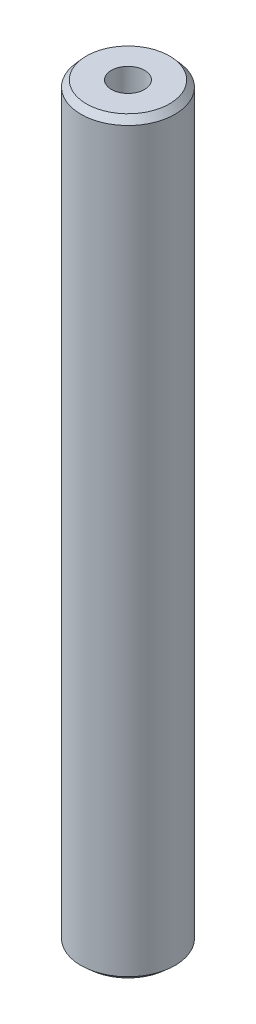
ISO-10303-21;
HEADER;
FILE_DESCRIPTION(('STEP AP214'),'2;1');
FILE_NAME('part.step','',(''),(''),'','','');
FILE_SCHEMA(('AUTOMOTIVE_DESIGN { 1 0 10303 214 1 1 1 1 }'));
ENDSEC;
DATA;
#1=APPLICATION_CONTEXT('core data for automotive mechanical design processes');
#2=APPLICATION_PROTOCOL_DEFINITION('international standard','automotive_design',2000,#1);
#3=PRODUCT_CONTEXT('',#1,'mechanical');
#4=PRODUCT('Part','Part','',(#3));
#5=PRODUCT_RELATED_PRODUCT_CATEGORY('part','',(#4));
#6=PRODUCT_DEFINITION_FORMATION('','',#4);
#7=PRODUCT_DEFINITION_CONTEXT('part definition',#1,'design');
#8=PRODUCT_DEFINITION('design','',#6,#7);
#9=PRODUCT_DEFINITION_SHAPE('','',#8);
#10=(LENGTH_UNIT() NAMED_UNIT(*) SI_UNIT(.MILLI.,.METRE.));
#11=(NAMED_UNIT(*) PLANE_ANGLE_UNIT() SI_UNIT($,.RADIAN.));
#12=(NAMED_UNIT(*) SI_UNIT($,.STERADIAN.) SOLID_ANGLE_UNIT());
#13=UNCERTAINTY_MEASURE_WITH_UNIT(LENGTH_MEASURE(1.E-05),#10,'distance_accuracy_value','');
#14=(GEOMETRIC_REPRESENTATION_CONTEXT(3) GLOBAL_UNCERTAINTY_ASSIGNED_CONTEXT((#13)) GLOBAL_UNIT_ASSIGNED_CONTEXT((#10,
#11,#12)) REPRESENTATION_CONTEXT('',''));
#15=CARTESIAN_POINT('',(0.,0.,0.));
#16=DIRECTION('',(0.,0.,1.));
#17=DIRECTION('',(1.,0.,0.));
#18=AXIS2_PLACEMENT_3D('',#15,#16,#17);
#19=CARTESIAN_POINT('',(0.,397.995592836643,0.));
#20=DIRECTION('',(0.,-1.,0.));
#21=DIRECTION('',(0.,0.,-1.));
#22=AXIS2_PLACEMENT_3D('',#19,#20,#21);
#23=CYLINDRICAL_SURFACE('',#22,25.);
#24=CARTESIAN_POINT('',(0.,394.669524556572,0.));
#25=DIRECTION('',(0.,1.,0.));
#26=DIRECTION('',(0.,0.,1.));
#27=AXIS2_PLACEMENT_3D('',#24,#25,#26);
#28=CIRCLE('',#27,25.);
#29=CARTESIAN_POINT('',(0.,394.669524556572,25.));
#30=VERTEX_POINT('',#29);
#31=EDGE_CURVE('E50',#30,#30,#28,.F.);
#32=ORIENTED_EDGE('',*,*,#31,.T.);
#33=EDGE_LOOP('',(#32));
#34=FACE_BOUND('',#33,.T.);
#35=CARTESIAN_POINT('',(0.,2.93456230092742,0.));
#36=DIRECTION('',(0.,1.,0.));
#37=DIRECTION('',(0.,0.,1.));
#38=AXIS2_PLACEMENT_3D('',#35,#36,#37);
#39=CIRCLE('',#38,25.);
#40=CARTESIAN_POINT('',(0.,2.93456230092742,25.));
#41=VERTEX_POINT('',#40);
#42=EDGE_CURVE('E51',#41,#41,#39,.T.);
#43=ORIENTED_EDGE('',*,*,#42,.T.);
#44=EDGE_LOOP('',(#43));
#45=FACE_BOUND('',#44,.T.);
#46=ADVANCED_FACE('F39',(#34,#45),#23,.T.);
#47=CARTESIAN_POINT('',(0.,397.995592836643,0.));
#48=DIRECTION('',(0.,1.,0.));
#49=DIRECTION('',(0.,0.,1.));
#50=AXIS2_PLACEMENT_3D('',#47,#48,#49);
#51=PLANE('',#50);
#52=CARTESIAN_POINT('',(0.,397.995592836643,0.));
#53=DIRECTION('',(0.,1.,0.));
#54=DIRECTION('',(0.,0.,1.));
#55=AXIS2_PLACEMENT_3D('',#52,#53,#54);
#56=CIRCLE('',#55,22.0654376990727);
#57=CARTESIAN_POINT('',(0.,397.995592836643,22.0654376990727));
#58=VERTEX_POINT('',#57);
#59=EDGE_CURVE('E54',#58,#58,#56,.T.);
#60=ORIENTED_EDGE('',*,*,#59,.T.);
#61=EDGE_LOOP('',(#60));
#62=FACE_BOUND('',#61,.T.);
#63=CARTESIAN_POINT('',(0.,397.995592836643,0.));
#64=DIRECTION('',(0.,1.,0.));
#65=DIRECTION('',(0.,0.,1.));
#66=AXIS2_PLACEMENT_3D('',#63,#64,#65);
#67=CIRCLE('',#66,8.82689840945199);
#68=CARTESIAN_POINT('',(0.,397.995592836643,8.82689840945199));
#69=VERTEX_POINT('',#68);
#70=EDGE_CURVE('E58',#69,#69,#67,.T.);
#71=ORIENTED_EDGE('',*,*,#70,.F.);
#72=EDGE_LOOP('',(#71));
#73=FACE_BOUND('',#72,.T.);
#74=ADVANCED_FACE('F69',(#62,#73),#51,.T.);
#75=CARTESIAN_POINT('',(0.,0.,0.));
#76=DIRECTION('',(0.,1.,0.));
#77=DIRECTION('',(0.,0.,1.));
#78=AXIS2_PLACEMENT_3D('',#75,#76,#77);
#79=PLANE('',#78);
#80=CARTESIAN_POINT('',(0.,0.,0.));
#81=DIRECTION('',(0.,1.,0.));
#82=DIRECTION('',(0.,0.,1.));
#83=AXIS2_PLACEMENT_3D('',#80,#81,#82);
#84=CIRCLE('',#83,21.6739317199297);
#85=CARTESIAN_POINT('',(0.,0.,21.6739317199297));
#86=VERTEX_POINT('',#85);
#87=EDGE_CURVE('E10',#86,#86,#84,.F.);
#88=ORIENTED_EDGE('',*,*,#87,.T.);
#89=EDGE_LOOP('',(#88));
#90=FACE_BOUND('',#89,.T.);
#91=CARTESIAN_POINT('',(0.,0.,0.));
#92=DIRECTION('',(0.,1.,0.));
#93=DIRECTION('',(0.,0.,1.));
#94=AXIS2_PLACEMENT_3D('',#91,#92,#93);
#95=CIRCLE('',#94,8.82689840945199);
#96=CARTESIAN_POINT('',(0.,0.,8.82689840945199));
#97=VERTEX_POINT('',#96);
#98=EDGE_CURVE('E63',#97,#97,#95,.T.);
#99=ORIENTED_EDGE('',*,*,#98,.T.);
#100=EDGE_LOOP('',(#99));
#101=FACE_BOUND('',#100,.T.);
#102=ADVANCED_FACE('F75',(#90,#101),#79,.F.);
#103=CARTESIAN_POINT('',(0.,397.995592836643,0.));
#104=DIRECTION('',(0.,-1.,0.));
#105=DIRECTION('',(0.,0.,-1.));
#106=AXIS2_PLACEMENT_3D('',#103,#104,#105);
#107=CYLINDRICAL_SURFACE('',#106,8.82689840945199);
#108=ORIENTED_EDGE('',*,*,#70,.T.);
#109=EDGE_LOOP('',(#108));
#110=FACE_BOUND('',#109,.T.);
#111=ORIENTED_EDGE('',*,*,#98,.F.);
#112=EDGE_LOOP('',(#111));
#113=FACE_BOUND('',#112,.T.);
#114=ADVANCED_FACE('F70',(#110,#113),#107,.F.);
#115=CARTESIAN_POINT('',(0.,397.995592836643,0.));
#116=DIRECTION('',(0.,-1.,0.));
#117=DIRECTION('',(0.,0.,-1.));
#118=AXIS2_PLACEMENT_3D('',#115,#116,#117);
#119=CONICAL_SURFACE('',#118,22.0654376990727,0.72294489605942);
#120=ORIENTED_EDGE('',*,*,#31,.F.);
#121=EDGE_LOOP('',(#120));
#122=FACE_BOUND('',#121,.T.);
#123=ORIENTED_EDGE('',*,*,#59,.F.);
#124=EDGE_LOOP('',(#123));
#125=FACE_BOUND('',#124,.T.);
#126=ADVANCED_FACE('F81',(#122,#125),#119,.T.);
#127=CARTESIAN_POINT('',(0.,2.93456230092742,0.));
#128=DIRECTION('',(0.,1.,0.));
#129=DIRECTION('',(0.,0.,1.));
#130=AXIS2_PLACEMENT_3D('',#127,#128,#129);
#131=CONICAL_SURFACE('',#130,25.,0.847851430735469);
#132=ORIENTED_EDGE('',*,*,#87,.F.);
#133=EDGE_LOOP('',(#132));
#134=FACE_BOUND('',#133,.T.);
#135=ORIENTED_EDGE('',*,*,#42,.F.);
#136=EDGE_LOOP('',(#135));
#137=FACE_BOUND('',#136,.T.);
#138=ADVANCED_FACE('F45',(#134,#137),#131,.T.);
#139=CLOSED_SHELL('',(#46,#74,#102,#114,#126,#138));
#140=MANIFOLD_SOLID_BREP('B2',#139);
#141=ADVANCED_BREP_SHAPE_REPRESENTATION('',(#18,#140),#14);
#142=SHAPE_DEFINITION_REPRESENTATION(#9,#141);
ENDSEC;
END-ISO-10303-21;
